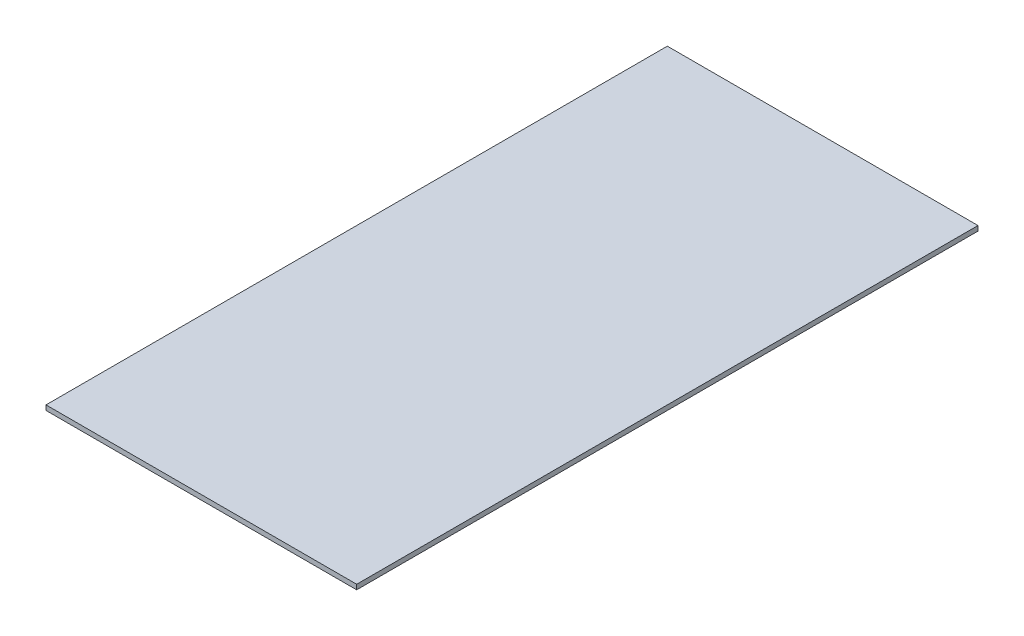
ISO-10303-21;
HEADER;
FILE_DESCRIPTION(('STEP AP214'),'2;1');
FILE_NAME('part.step','',(''),(''),'','','');
FILE_SCHEMA(('AUTOMOTIVE_DESIGN { 1 0 10303 214 1 1 1 1 }'));
ENDSEC;
DATA;
#1=APPLICATION_CONTEXT('core data for automotive mechanical design processes');
#2=APPLICATION_PROTOCOL_DEFINITION('international standard','automotive_design',2000,#1);
#3=PRODUCT_CONTEXT('',#1,'mechanical');
#4=PRODUCT('Part','Part','',(#3));
#5=PRODUCT_RELATED_PRODUCT_CATEGORY('part','',(#4));
#6=PRODUCT_DEFINITION_FORMATION('','',#4);
#7=PRODUCT_DEFINITION_CONTEXT('part definition',#1,'design');
#8=PRODUCT_DEFINITION('design','',#6,#7);
#9=PRODUCT_DEFINITION_SHAPE('','',#8);
#10=(LENGTH_UNIT() NAMED_UNIT(*) SI_UNIT(.MILLI.,.METRE.));
#11=(NAMED_UNIT(*) PLANE_ANGLE_UNIT() SI_UNIT($,.RADIAN.));
#12=(NAMED_UNIT(*) SI_UNIT($,.STERADIAN.) SOLID_ANGLE_UNIT());
#13=UNCERTAINTY_MEASURE_WITH_UNIT(LENGTH_MEASURE(1.E-05),#10,'distance_accuracy_value','');
#14=(GEOMETRIC_REPRESENTATION_CONTEXT(3) GLOBAL_UNCERTAINTY_ASSIGNED_CONTEXT((#13)) GLOBAL_UNIT_ASSIGNED_CONTEXT((#10,
#11,#12)) REPRESENTATION_CONTEXT('',''));
#15=CARTESIAN_POINT('',(0.,0.,0.));
#16=DIRECTION('',(0.,0.,1.));
#17=DIRECTION('',(1.,0.,0.));
#18=AXIS2_PLACEMENT_3D('',#15,#16,#17);
#19=CARTESIAN_POINT('',(0.,3.175,0.));
#20=DIRECTION('',(-1.,0.,0.));
#21=DIRECTION('',(0.,0.,1.));
#22=AXIS2_PLACEMENT_3D('',#19,#20,#21);
#23=PLANE('',#22);
#24=DIRECTION('',(0.,0.,-1.));
#25=VECTOR('',#24,1.);
#26=CARTESIAN_POINT('',(0.,0.,0.));
#27=LINE('',#26,#25);
#28=CARTESIAN_POINT('',(0.,0.,406.4));
#29=VERTEX_POINT('',#28);
#30=CARTESIAN_POINT('',(0.,0.,0.));
#31=VERTEX_POINT('',#30);
#32=EDGE_CURVE('E97',#29,#31,#27,.T.);
#33=ORIENTED_EDGE('',*,*,#32,.T.);
#34=DIRECTION('',(0.,-1.,0.));
#35=VECTOR('',#34,1.);
#36=CARTESIAN_POINT('',(0.,3.175,0.));
#37=LINE('',#36,#35);
#38=CARTESIAN_POINT('',(0.,3.175,0.));
#39=VERTEX_POINT('',#38);
#40=EDGE_CURVE('E11',#39,#31,#37,.T.);
#41=ORIENTED_EDGE('',*,*,#40,.F.);
#42=DIRECTION('',(0.,0.,-1.));
#43=VECTOR('',#42,1.);
#44=CARTESIAN_POINT('',(0.,3.175,0.));
#45=LINE('',#44,#43);
#46=CARTESIAN_POINT('',(0.,3.175,406.4));
#47=VERTEX_POINT('',#46);
#48=EDGE_CURVE('E85',#47,#39,#45,.T.);
#49=ORIENTED_EDGE('',*,*,#48,.F.);
#50=DIRECTION('',(0.,-1.,0.));
#51=VECTOR('',#50,1.);
#52=CARTESIAN_POINT('',(0.,3.175,406.4));
#53=LINE('',#52,#51);
#54=EDGE_CURVE('E93',#47,#29,#53,.T.);
#55=ORIENTED_EDGE('',*,*,#54,.T.);
#56=EDGE_LOOP('',(#33,#41,#49,#55));
#57=FACE_BOUND('',#56,.T.);
#58=ADVANCED_FACE('F34',(#57),#23,.F.);
#59=CARTESIAN_POINT('',(0.,3.175,0.));
#60=DIRECTION('',(0.,0.,1.));
#61=DIRECTION('',(1.,0.,0.));
#62=AXIS2_PLACEMENT_3D('',#59,#60,#61);
#63=PLANE('',#62);
#64=DIRECTION('',(-1.,0.,0.));
#65=VECTOR('',#64,1.);
#66=CARTESIAN_POINT('',(0.,0.,0.));
#67=LINE('',#66,#65);
#68=CARTESIAN_POINT('',(-203.2,0.,0.));
#69=VERTEX_POINT('',#68);
#70=EDGE_CURVE('E89',#31,#69,#67,.T.);
#71=ORIENTED_EDGE('',*,*,#70,.T.);
#72=DIRECTION('',(0.,-1.,0.));
#73=VECTOR('',#72,1.);
#74=CARTESIAN_POINT('',(-203.2,3.175,0.));
#75=LINE('',#74,#73);
#76=CARTESIAN_POINT('',(-203.2,3.175,0.));
#77=VERTEX_POINT('',#76);
#78=EDGE_CURVE('E42',#77,#69,#75,.T.);
#79=ORIENTED_EDGE('',*,*,#78,.F.);
#80=DIRECTION('',(-1.,0.,0.));
#81=VECTOR('',#80,1.);
#82=CARTESIAN_POINT('',(0.,3.175,0.));
#83=LINE('',#82,#81);
#84=EDGE_CURVE('E80',#39,#77,#83,.T.);
#85=ORIENTED_EDGE('',*,*,#84,.F.);
#86=ORIENTED_EDGE('',*,*,#40,.T.);
#87=EDGE_LOOP('',(#71,#79,#85,#86));
#88=FACE_BOUND('',#87,.T.);
#89=ADVANCED_FACE('F88',(#88),#63,.F.);
#90=CARTESIAN_POINT('',(-203.2,3.175,0.));
#91=DIRECTION('',(1.,0.,0.));
#92=DIRECTION('',(0.,0.,-1.));
#93=AXIS2_PLACEMENT_3D('',#90,#91,#92);
#94=PLANE('',#93);
#95=DIRECTION('',(0.,0.,1.));
#96=VECTOR('',#95,1.);
#97=CARTESIAN_POINT('',(-203.2,0.,0.));
#98=LINE('',#97,#96);
#99=CARTESIAN_POINT('',(-203.2,0.,406.4));
#100=VERTEX_POINT('',#99);
#101=EDGE_CURVE('E67',#69,#100,#98,.T.);
#102=ORIENTED_EDGE('',*,*,#101,.T.);
#103=DIRECTION('',(0.,-1.,0.));
#104=VECTOR('',#103,1.);
#105=CARTESIAN_POINT('',(-203.2,3.175,406.4));
#106=LINE('',#105,#104);
#107=CARTESIAN_POINT('',(-203.2,3.175,406.4));
#108=VERTEX_POINT('',#107);
#109=EDGE_CURVE('E90',#108,#100,#106,.T.);
#110=ORIENTED_EDGE('',*,*,#109,.F.);
#111=DIRECTION('',(0.,0.,1.));
#112=VECTOR('',#111,1.);
#113=CARTESIAN_POINT('',(-203.2,3.175,0.));
#114=LINE('',#113,#112);
#115=EDGE_CURVE('E83',#77,#108,#114,.T.);
#116=ORIENTED_EDGE('',*,*,#115,.F.);
#117=ORIENTED_EDGE('',*,*,#78,.T.);
#118=EDGE_LOOP('',(#102,#110,#116,#117));
#119=FACE_BOUND('',#118,.T.);
#120=ADVANCED_FACE('F91',(#119),#94,.F.);
#121=CARTESIAN_POINT('',(0.,3.175,406.4));
#122=DIRECTION('',(0.,0.,-1.));
#123=DIRECTION('',(-1.,0.,0.));
#124=AXIS2_PLACEMENT_3D('',#121,#122,#123);
#125=PLANE('',#124);
#126=DIRECTION('',(1.,0.,0.));
#127=VECTOR('',#126,1.);
#128=CARTESIAN_POINT('',(0.,0.,406.4));
#129=LINE('',#128,#127);
#130=EDGE_CURVE('E73',#100,#29,#129,.T.);
#131=ORIENTED_EDGE('',*,*,#130,.T.);
#132=ORIENTED_EDGE('',*,*,#54,.F.);
#133=DIRECTION('',(1.,0.,0.));
#134=VECTOR('',#133,1.);
#135=CARTESIAN_POINT('',(0.,3.175,406.4));
#136=LINE('',#135,#134);
#137=EDGE_CURVE('E50',#108,#47,#136,.T.);
#138=ORIENTED_EDGE('',*,*,#137,.F.);
#139=ORIENTED_EDGE('',*,*,#109,.T.);
#140=EDGE_LOOP('',(#131,#132,#138,#139));
#141=FACE_BOUND('',#140,.T.);
#142=ADVANCED_FACE('F104',(#141),#125,.F.);
#143=CARTESIAN_POINT('',(0.,3.175,0.));
#144=DIRECTION('',(0.,-1.,0.));
#145=DIRECTION('',(0.,0.,-1.));
#146=AXIS2_PLACEMENT_3D('',#143,#144,#145);
#147=PLANE('',#146);
#148=ORIENTED_EDGE('',*,*,#48,.T.);
#149=ORIENTED_EDGE('',*,*,#84,.T.);
#150=ORIENTED_EDGE('',*,*,#115,.T.);
#151=ORIENTED_EDGE('',*,*,#137,.T.);
#152=EDGE_LOOP('',(#148,#149,#150,#151));
#153=FACE_BOUND('',#152,.T.);
#154=ADVANCED_FACE('F81',(#153),#147,.F.);
#155=CARTESIAN_POINT('',(0.,0.,0.));
#156=DIRECTION('',(0.,-1.,0.));
#157=DIRECTION('',(0.,0.,-1.));
#158=AXIS2_PLACEMENT_3D('',#155,#156,#157);
#159=PLANE('',#158);
#160=ORIENTED_EDGE('',*,*,#32,.F.);
#161=ORIENTED_EDGE('',*,*,#130,.F.);
#162=ORIENTED_EDGE('',*,*,#101,.F.);
#163=ORIENTED_EDGE('',*,*,#70,.F.);
#164=EDGE_LOOP('',(#160,#161,#162,#163));
#165=FACE_BOUND('',#164,.T.);
#166=ADVANCED_FACE('F107',(#165),#159,.T.);
#167=CLOSED_SHELL('',(#58,#89,#120,#142,#154,#166));
#168=MANIFOLD_SOLID_BREP('B2',#167);
#169=ADVANCED_BREP_SHAPE_REPRESENTATION('',(#18,#168),#14);
#170=SHAPE_DEFINITION_REPRESENTATION(#9,#169);
ENDSEC;
END-ISO-10303-21;
